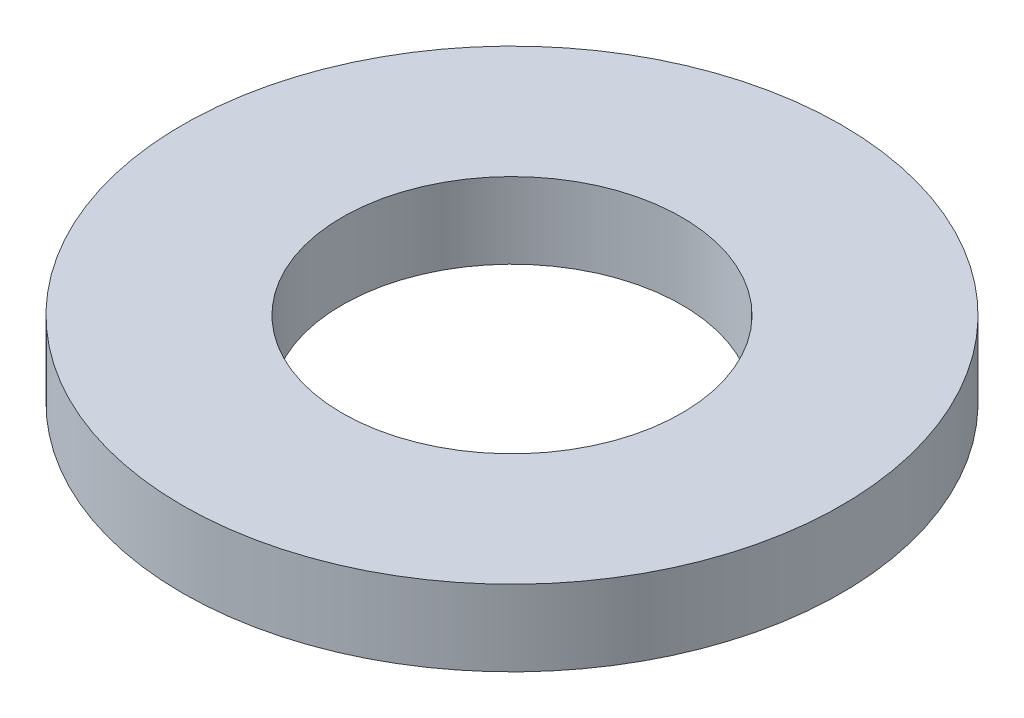
ISO-10303-21;
HEADER;
FILE_DESCRIPTION(('STEP AP214'),'2;1');
FILE_NAME('part.step','',(''),(''),'','','');
FILE_SCHEMA(('AUTOMOTIVE_DESIGN { 1 0 10303 214 1 1 1 1 }'));
ENDSEC;
DATA;
#1=APPLICATION_CONTEXT('core data for automotive mechanical design processes');
#2=APPLICATION_PROTOCOL_DEFINITION('international standard','automotive_design',2000,#1);
#3=PRODUCT_CONTEXT('',#1,'mechanical');
#4=PRODUCT('Part','Part','',(#3));
#5=PRODUCT_RELATED_PRODUCT_CATEGORY('part','',(#4));
#6=PRODUCT_DEFINITION_FORMATION('','',#4);
#7=PRODUCT_DEFINITION_CONTEXT('part definition',#1,'design');
#8=PRODUCT_DEFINITION('design','',#6,#7);
#9=PRODUCT_DEFINITION_SHAPE('','',#8);
#10=(LENGTH_UNIT() NAMED_UNIT(*) SI_UNIT(.MILLI.,.METRE.));
#11=(NAMED_UNIT(*) PLANE_ANGLE_UNIT() SI_UNIT($,.RADIAN.));
#12=(NAMED_UNIT(*) SI_UNIT($,.STERADIAN.) SOLID_ANGLE_UNIT());
#13=UNCERTAINTY_MEASURE_WITH_UNIT(LENGTH_MEASURE(1.E-05),#10,'distance_accuracy_value','');
#14=(GEOMETRIC_REPRESENTATION_CONTEXT(3) GLOBAL_UNCERTAINTY_ASSIGNED_CONTEXT((#13)) GLOBAL_UNIT_ASSIGNED_CONTEXT((#10,
#11,#12)) REPRESENTATION_CONTEXT('',''));
#15=CARTESIAN_POINT('',(0.,0.,0.));
#16=DIRECTION('',(0.,0.,1.));
#17=DIRECTION('',(1.,0.,0.));
#18=AXIS2_PLACEMENT_3D('',#15,#16,#17);
#19=CARTESIAN_POINT('',(0.,19.,0.));
#20=DIRECTION('',(0.,-1.,0.));
#21=DIRECTION('',(0.,0.,-1.));
#22=AXIS2_PLACEMENT_3D('',#19,#20,#21);
#23=CYLINDRICAL_SURFACE('',#22,82.5);
#24=CARTESIAN_POINT('',(0.,19.,0.));
#25=DIRECTION('',(0.,1.,0.));
#26=DIRECTION('',(0.,0.,1.));
#27=AXIS2_PLACEMENT_3D('',#24,#25,#26);
#28=CIRCLE('',#27,82.5);
#29=CARTESIAN_POINT('',(0.,19.,82.5));
#30=VERTEX_POINT('',#29);
#31=EDGE_CURVE('E10',#30,#30,#28,.T.);
#32=ORIENTED_EDGE('',*,*,#31,.F.);
#33=EDGE_LOOP('',(#32));
#34=FACE_BOUND('',#33,.T.);
#35=CARTESIAN_POINT('',(0.,0.,0.));
#36=DIRECTION('',(0.,1.,0.));
#37=DIRECTION('',(0.,0.,1.));
#38=AXIS2_PLACEMENT_3D('',#35,#36,#37);
#39=CIRCLE('',#38,82.5);
#40=CARTESIAN_POINT('',(0.,0.,82.5));
#41=VERTEX_POINT('',#40);
#42=EDGE_CURVE('E37',#41,#41,#39,.T.);
#43=ORIENTED_EDGE('',*,*,#42,.T.);
#44=EDGE_LOOP('',(#43));
#45=FACE_BOUND('',#44,.T.);
#46=ADVANCED_FACE('F40',(#34,#45),#23,.T.);
#47=CARTESIAN_POINT('',(0.,19.,0.));
#48=DIRECTION('',(0.,1.,0.));
#49=DIRECTION('',(0.,0.,1.));
#50=AXIS2_PLACEMENT_3D('',#47,#48,#49);
#51=PLANE('',#50);
#52=CARTESIAN_POINT('',(0.,19.,0.));
#53=DIRECTION('',(0.,1.,0.));
#54=DIRECTION('',(0.,0.,1.));
#55=AXIS2_PLACEMENT_3D('',#52,#53,#54);
#56=CIRCLE('',#55,42.5);
#57=CARTESIAN_POINT('',(0.,19.,42.5));
#58=VERTEX_POINT('',#57);
#59=EDGE_CURVE('E50',#58,#58,#56,.T.);
#60=ORIENTED_EDGE('',*,*,#59,.F.);
#61=EDGE_LOOP('',(#60));
#62=FACE_BOUND('',#61,.T.);
#63=ORIENTED_EDGE('',*,*,#31,.T.);
#64=EDGE_LOOP('',(#63));
#65=FACE_BOUND('',#64,.T.);
#66=ADVANCED_FACE('F59',(#62,#65),#51,.T.);
#67=CARTESIAN_POINT('',(0.,0.,0.));
#68=DIRECTION('',(0.,1.,0.));
#69=DIRECTION('',(0.,0.,1.));
#70=AXIS2_PLACEMENT_3D('',#67,#68,#69);
#71=PLANE('',#70);
#72=CARTESIAN_POINT('',(0.,0.,0.));
#73=DIRECTION('',(0.,1.,0.));
#74=DIRECTION('',(0.,0.,1.));
#75=AXIS2_PLACEMENT_3D('',#72,#73,#74);
#76=CIRCLE('',#75,42.5);
#77=CARTESIAN_POINT('',(0.,0.,42.5));
#78=VERTEX_POINT('',#77);
#79=EDGE_CURVE('E47',#78,#78,#76,.T.);
#80=ORIENTED_EDGE('',*,*,#79,.T.);
#81=EDGE_LOOP('',(#80));
#82=FACE_BOUND('',#81,.T.);
#83=ORIENTED_EDGE('',*,*,#42,.F.);
#84=EDGE_LOOP('',(#83));
#85=FACE_BOUND('',#84,.T.);
#86=ADVANCED_FACE('F58',(#82,#85),#71,.F.);
#87=CARTESIAN_POINT('',(0.,19.,0.));
#88=DIRECTION('',(0.,-1.,0.));
#89=DIRECTION('',(0.,0.,-1.));
#90=AXIS2_PLACEMENT_3D('',#87,#88,#89);
#91=CYLINDRICAL_SURFACE('',#90,42.5);
#92=ORIENTED_EDGE('',*,*,#59,.T.);
#93=EDGE_LOOP('',(#92));
#94=FACE_BOUND('',#93,.T.);
#95=ORIENTED_EDGE('',*,*,#79,.F.);
#96=EDGE_LOOP('',(#95));
#97=FACE_BOUND('',#96,.T.);
#98=ADVANCED_FACE('F54',(#94,#97),#91,.F.);
#99=CLOSED_SHELL('',(#46,#66,#86,#98));
#100=MANIFOLD_SOLID_BREP('B2',#99);
#101=ADVANCED_BREP_SHAPE_REPRESENTATION('',(#18,#100),#14);
#102=SHAPE_DEFINITION_REPRESENTATION(#9,#101);
ENDSEC;
END-ISO-10303-21;
